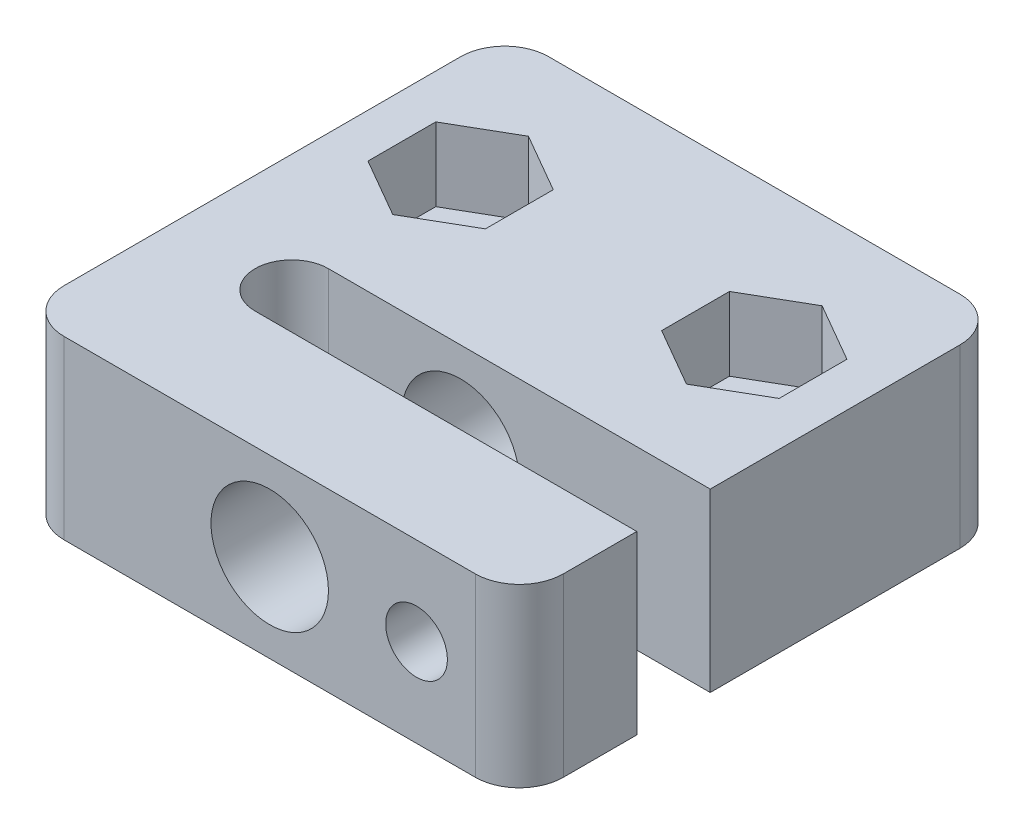
ISO-10303-21;
HEADER;
FILE_DESCRIPTION(('STEP AP214'),'2;1');
FILE_NAME('part.step','',(''),(''),'','','');
FILE_SCHEMA(('AUTOMOTIVE_DESIGN { 1 0 10303 214 1 1 1 1 }'));
ENDSEC;
DATA;
#1=APPLICATION_CONTEXT('core data for automotive mechanical design processes');
#2=APPLICATION_PROTOCOL_DEFINITION('international standard','automotive_design',2000,#1);
#3=PRODUCT_CONTEXT('',#1,'mechanical');
#4=PRODUCT('Part','Part','',(#3));
#5=PRODUCT_RELATED_PRODUCT_CATEGORY('part','',(#4));
#6=PRODUCT_DEFINITION_FORMATION('','',#4);
#7=PRODUCT_DEFINITION_CONTEXT('part definition',#1,'design');
#8=PRODUCT_DEFINITION('design','',#6,#7);
#9=PRODUCT_DEFINITION_SHAPE('','',#8);
#10=(LENGTH_UNIT() NAMED_UNIT(*) SI_UNIT(.MILLI.,.METRE.));
#11=(NAMED_UNIT(*) PLANE_ANGLE_UNIT() SI_UNIT($,.RADIAN.));
#12=(NAMED_UNIT(*) SI_UNIT($,.STERADIAN.) SOLID_ANGLE_UNIT());
#13=UNCERTAINTY_MEASURE_WITH_UNIT(LENGTH_MEASURE(1.E-05),#10,'distance_accuracy_value','');
#14=(GEOMETRIC_REPRESENTATION_CONTEXT(3) GLOBAL_UNCERTAINTY_ASSIGNED_CONTEXT((#13)) GLOBAL_UNIT_ASSIGNED_CONTEXT((#10,
#11,#12)) REPRESENTATION_CONTEXT('',''));
#15=CARTESIAN_POINT('',(0.,0.,0.));
#16=DIRECTION('',(0.,0.,1.));
#17=DIRECTION('',(1.,0.,0.));
#18=AXIS2_PLACEMENT_3D('',#15,#16,#17);
#19=CARTESIAN_POINT('',(17.,-6.,33.));
#20=DIRECTION('',(-1.,0.,0.));
#21=DIRECTION('',(0.,0.,1.));
#22=AXIS2_PLACEMENT_3D('',#19,#20,#21);
#23=PLANE('',#22);
#24=DIRECTION('',(0.,0.,-1.));
#25=VECTOR('',#24,1.);
#26=CARTESIAN_POINT('',(17.,6.,33.));
#27=LINE('',#26,#25);
#28=CARTESIAN_POINT('',(17.,6.,30.));
#29=VERTEX_POINT('',#28);
#30=CARTESIAN_POINT('',(17.,6.,25.));
#31=VERTEX_POINT('',#30);
#32=EDGE_CURVE('E226',#29,#31,#27,.T.);
#33=ORIENTED_EDGE('',*,*,#32,.F.);
#34=DIRECTION('',(0.,1.,0.));
#35=VECTOR('',#34,1.);
#36=CARTESIAN_POINT('',(17.,-6.,30.));
#37=LINE('',#36,#35);
#38=CARTESIAN_POINT('',(17.,-6.,30.));
#39=VERTEX_POINT('',#38);
#40=EDGE_CURVE('E11',#29,#39,#37,.F.);
#41=ORIENTED_EDGE('',*,*,#40,.T.);
#42=DIRECTION('',(0.,0.,-1.));
#43=VECTOR('',#42,1.);
#44=CARTESIAN_POINT('',(17.,-6.,33.));
#45=LINE('',#44,#43);
#46=CARTESIAN_POINT('',(17.,-6.,25.));
#47=VERTEX_POINT('',#46);
#48=EDGE_CURVE('E225',#39,#47,#45,.T.);
#49=ORIENTED_EDGE('',*,*,#48,.T.);
#50=DIRECTION('',(0.,1.,0.));
#51=VECTOR('',#50,1.);
#52=CARTESIAN_POINT('',(17.,-6.,25.));
#53=LINE('',#52,#51);
#54=EDGE_CURVE('E258',#47,#31,#53,.T.);
#55=ORIENTED_EDGE('',*,*,#54,.T.);
#56=EDGE_LOOP('',(#33,#41,#49,#55));
#57=FACE_BOUND('',#56,.T.);
#58=ADVANCED_FACE('F32',(#57),#23,.F.);
#59=CARTESIAN_POINT('',(0.,0.,0.));
#60=DIRECTION('',(0.,0.,1.));
#61=DIRECTION('',(1.,0.,0.));
#62=AXIS2_PLACEMENT_3D('',#59,#60,#61);
#63=CYLINDRICAL_SURFACE('',#62,4.);
#64=CARTESIAN_POINT('',(0.,0.,25.));
#65=DIRECTION('',(0.,0.,1.));
#66=DIRECTION('',(1.,0.,0.));
#67=AXIS2_PLACEMENT_3D('',#64,#65,#66);
#68=CIRCLE('',#67,4.);
#69=CARTESIAN_POINT('',(4.,0.,25.));
#70=VERTEX_POINT('',#69);
#71=EDGE_CURVE('E257',#70,#70,#68,.F.);
#72=ORIENTED_EDGE('',*,*,#71,.T.);
#73=EDGE_LOOP('',(#72));
#74=FACE_BOUND('',#73,.T.);
#75=CARTESIAN_POINT('',(0.,0.,33.));
#76=DIRECTION('',(0.,0.,1.));
#77=DIRECTION('',(1.,0.,0.));
#78=AXIS2_PLACEMENT_3D('',#75,#76,#77);
#79=CIRCLE('',#78,4.);
#80=CARTESIAN_POINT('',(4.,0.,33.));
#81=VERTEX_POINT('',#80);
#82=EDGE_CURVE('E237',#81,#81,#79,.T.);
#83=ORIENTED_EDGE('',*,*,#82,.T.);
#84=EDGE_LOOP('',(#83));
#85=FACE_BOUND('',#84,.T.);
#86=ADVANCED_FACE('F329',(#74,#85),#63,.F.);
#87=CARTESIAN_POINT('',(-10.,-6.00000000000001,10.));
#88=DIRECTION('',(0.,1.,0.));
#89=DIRECTION('',(-1.,0.,0.));
#90=AXIS2_PLACEMENT_3D('',#87,#88,#89);
#91=CYLINDRICAL_SURFACE('',#90,2.55);
#92=CARTESIAN_POINT('',(-10.,1.,10.));
#93=DIRECTION('',(0.,1.,0.));
#94=DIRECTION('',(0.,0.,1.));
#95=AXIS2_PLACEMENT_3D('',#92,#93,#94);
#96=CIRCLE('',#95,2.55);
#97=CARTESIAN_POINT('',(-10.,1.,12.55));
#98=VERTEX_POINT('',#97);
#99=EDGE_CURVE('E234',#98,#98,#96,.F.);
#100=ORIENTED_EDGE('',*,*,#99,.F.);
#101=EDGE_LOOP('',(#100));
#102=FACE_BOUND('',#101,.T.);
#103=CARTESIAN_POINT('',(-10.,-4.,10.));
#104=DIRECTION('',(0.,-1.,0.));
#105=DIRECTION('',(1.,0.,0.));
#106=AXIS2_PLACEMENT_3D('',#103,#104,#105);
#107=CIRCLE('',#106,2.55);
#108=CARTESIAN_POINT('',(-7.45,-4.,10.));
#109=VERTEX_POINT('',#108);
#110=EDGE_CURVE('E249',#109,#109,#107,.F.);
#111=ORIENTED_EDGE('',*,*,#110,.F.);
#112=EDGE_LOOP('',(#111));
#113=FACE_BOUND('',#112,.T.);
#114=ADVANCED_FACE('F335',(#102,#113),#91,.F.);
#115=CARTESIAN_POINT('',(10.,-6.00000000000001,10.));
#116=DIRECTION('',(0.,1.,0.));
#117=DIRECTION('',(-1.,0.,0.));
#118=AXIS2_PLACEMENT_3D('',#115,#116,#117);
#119=CYLINDRICAL_SURFACE('',#118,2.55);
#120=CARTESIAN_POINT('',(10.,1.,10.));
#121=DIRECTION('',(0.,-1.,0.));
#122=DIRECTION('',(1.,0.,0.));
#123=AXIS2_PLACEMENT_3D('',#120,#121,#122);
#124=CIRCLE('',#123,2.55);
#125=CARTESIAN_POINT('',(12.55,1.,10.));
#126=VERTEX_POINT('',#125);
#127=EDGE_CURVE('E239',#126,#126,#124,.F.);
#128=ORIENTED_EDGE('',*,*,#127,.T.);
#129=EDGE_LOOP('',(#128));
#130=FACE_BOUND('',#129,.T.);
#131=CARTESIAN_POINT('',(10.,-4.,10.));
#132=DIRECTION('',(0.,-1.,0.));
#133=DIRECTION('',(1.,0.,0.));
#134=AXIS2_PLACEMENT_3D('',#131,#132,#133);
#135=CIRCLE('',#134,2.55);
#136=CARTESIAN_POINT('',(12.55,-4.,10.));
#137=VERTEX_POINT('',#136);
#138=EDGE_CURVE('E244',#137,#137,#135,.F.);
#139=ORIENTED_EDGE('',*,*,#138,.F.);
#140=EDGE_LOOP('',(#139));
#141=FACE_BOUND('',#140,.T.);
#142=ADVANCED_FACE('F351',(#130,#141),#119,.F.);
#143=CARTESIAN_POINT('',(-17.,-6.,33.));
#144=DIRECTION('',(1.,0.,0.));
#145=DIRECTION('',(0.,0.,-1.));
#146=AXIS2_PLACEMENT_3D('',#143,#144,#145);
#147=PLANE('',#146);
#148=DIRECTION('',(0.,0.,-1.));
#149=VECTOR('',#148,1.);
#150=CARTESIAN_POINT('',(-17.,6.,33.));
#151=LINE('',#150,#149);
#152=CARTESIAN_POINT('',(-17.,6.,30.));
#153=VERTEX_POINT('',#152);
#154=CARTESIAN_POINT('',(-17.,6.,3.));
#155=VERTEX_POINT('',#154);
#156=EDGE_CURVE('E298',#153,#155,#151,.T.);
#157=ORIENTED_EDGE('',*,*,#156,.T.);
#158=DIRECTION('',(0.,-1.,0.));
#159=VECTOR('',#158,1.);
#160=CARTESIAN_POINT('',(-17.,-6.,3.));
#161=LINE('',#160,#159);
#162=CARTESIAN_POINT('',(-17.,-6.,3.));
#163=VERTEX_POINT('',#162);
#164=EDGE_CURVE('E263',#155,#163,#161,.T.);
#165=ORIENTED_EDGE('',*,*,#164,.T.);
#166=DIRECTION('',(0.,0.,-1.));
#167=VECTOR('',#166,1.);
#168=CARTESIAN_POINT('',(-17.,-6.,33.));
#169=LINE('',#168,#167);
#170=CARTESIAN_POINT('',(-17.,-6.,30.));
#171=VERTEX_POINT('',#170);
#172=EDGE_CURVE('E228',#171,#163,#169,.T.);
#173=ORIENTED_EDGE('',*,*,#172,.F.);
#174=DIRECTION('',(0.,-1.,0.));
#175=VECTOR('',#174,1.);
#176=CARTESIAN_POINT('',(-17.,6.,30.));
#177=LINE('',#176,#175);
#178=EDGE_CURVE('E233',#171,#153,#177,.F.);
#179=ORIENTED_EDGE('',*,*,#178,.T.);
#180=EDGE_LOOP('',(#157,#165,#173,#179));
#181=FACE_BOUND('',#180,.T.);
#182=ADVANCED_FACE('F318',(#181),#147,.F.);
#183=CARTESIAN_POINT('',(17.,-6.,33.));
#184=DIRECTION('',(0.,1.,0.));
#185=DIRECTION('',(-1.,0.,0.));
#186=AXIS2_PLACEMENT_3D('',#183,#184,#185);
#187=PLANE('',#186);
#188=CARTESIAN_POINT('',(-10.,-6.,10.));
#189=DIRECTION('',(0.,-1.,0.));
#190=DIRECTION('',(1.,0.,0.));
#191=AXIS2_PLACEMENT_3D('',#188,#189,#190);
#192=CIRCLE('',#191,4.5);
#193=CARTESIAN_POINT('',(-5.5,-6.,10.));
#194=VERTEX_POINT('',#193);
#195=EDGE_CURVE('E261',#194,#194,#192,.T.);
#196=ORIENTED_EDGE('',*,*,#195,.F.);
#197=EDGE_LOOP('',(#196));
#198=FACE_BOUND('',#197,.T.);
#199=CARTESIAN_POINT('',(10.,-6.,10.));
#200=DIRECTION('',(0.,-1.,0.));
#201=DIRECTION('',(1.,0.,0.));
#202=AXIS2_PLACEMENT_3D('',#199,#200,#201);
#203=CIRCLE('',#202,4.5);
#204=CARTESIAN_POINT('',(14.5,-6.,10.));
#205=VERTEX_POINT('',#204);
#206=EDGE_CURVE('E252',#205,#205,#203,.T.);
#207=ORIENTED_EDGE('',*,*,#206,.F.);
#208=EDGE_LOOP('',(#207));
#209=FACE_BOUND('',#208,.T.);
#210=ORIENTED_EDGE('',*,*,#172,.T.);
#211=CARTESIAN_POINT('',(-14.,-6.,3.));
#212=DIRECTION('',(0.,1.,0.));
#213=DIRECTION('',(-1.,0.,0.));
#214=AXIS2_PLACEMENT_3D('',#211,#212,#213);
#215=CIRCLE('',#214,3.);
#216=CARTESIAN_POINT('',(-14.,-6.,0.));
#217=VERTEX_POINT('',#216);
#218=EDGE_CURVE('E271',#163,#217,#215,.F.);
#219=ORIENTED_EDGE('',*,*,#218,.T.);
#220=DIRECTION('',(1.,0.,0.));
#221=VECTOR('',#220,1.);
#222=CARTESIAN_POINT('',(17.,-6.,0.));
#223=LINE('',#222,#221);
#224=CARTESIAN_POINT('',(14.,-6.,0.));
#225=VERTEX_POINT('',#224);
#226=EDGE_CURVE('E305',#217,#225,#223,.T.);
#227=ORIENTED_EDGE('',*,*,#226,.T.);
#228=CARTESIAN_POINT('',(14.,-6.,3.));
#229=DIRECTION('',(0.,1.,0.));
#230=DIRECTION('',(-1.,0.,0.));
#231=AXIS2_PLACEMENT_3D('',#228,#229,#230);
#232=CIRCLE('',#231,3.);
#233=CARTESIAN_POINT('',(17.,-6.,3.));
#234=VERTEX_POINT('',#233);
#235=EDGE_CURVE('E224',#225,#234,#232,.F.);
#236=ORIENTED_EDGE('',*,*,#235,.T.);
#237=CARTESIAN_POINT('',(17.,-6.,20.));
#238=VERTEX_POINT('',#237);
#239=EDGE_CURVE('E214',#238,#234,#45,.T.);
#240=ORIENTED_EDGE('',*,*,#239,.F.);
#241=DIRECTION('',(-1.,0.,0.));
#242=VECTOR('',#241,1.);
#243=CARTESIAN_POINT('',(17.,-6.,20.));
#244=LINE('',#243,#242);
#245=CARTESIAN_POINT('',(-9.,-6.00000000000001,20.));
#246=VERTEX_POINT('',#245);
#247=EDGE_CURVE('E194',#238,#246,#244,.T.);
#248=ORIENTED_EDGE('',*,*,#247,.T.);
#249=CARTESIAN_POINT('',(-9.,-6.00000000000001,22.5));
#250=DIRECTION('',(0.,1.,0.));
#251=DIRECTION('',(-1.,0.,0.));
#252=AXIS2_PLACEMENT_3D('',#249,#250,#251);
#253=CIRCLE('',#252,2.5);
#254=CARTESIAN_POINT('',(-9.,-6.00000000000001,25.));
#255=VERTEX_POINT('',#254);
#256=EDGE_CURVE('E206',#246,#255,#253,.T.);
#257=ORIENTED_EDGE('',*,*,#256,.T.);
#258=DIRECTION('',(1.,0.,0.));
#259=VECTOR('',#258,1.);
#260=CARTESIAN_POINT('',(17.,-6.,25.));
#261=LINE('',#260,#259);
#262=EDGE_CURVE('E218',#255,#47,#261,.T.);
#263=ORIENTED_EDGE('',*,*,#262,.T.);
#264=ORIENTED_EDGE('',*,*,#48,.F.);
#265=CARTESIAN_POINT('',(14.,-6.,30.));
#266=DIRECTION('',(0.,1.,0.));
#267=DIRECTION('',(-1.,0.,0.));
#268=AXIS2_PLACEMENT_3D('',#265,#266,#267);
#269=CIRCLE('',#268,3.);
#270=CARTESIAN_POINT('',(14.,-6.,33.));
#271=VERTEX_POINT('',#270);
#272=EDGE_CURVE('E268',#39,#271,#269,.F.);
#273=ORIENTED_EDGE('',*,*,#272,.T.);
#274=DIRECTION('',(1.,0.,0.));
#275=VECTOR('',#274,1.);
#276=CARTESIAN_POINT('',(17.,-6.,33.));
#277=LINE('',#276,#275);
#278=CARTESIAN_POINT('',(-14.,-6.,33.));
#279=VERTEX_POINT('',#278);
#280=EDGE_CURVE('E293',#279,#271,#277,.T.);
#281=ORIENTED_EDGE('',*,*,#280,.F.);
#282=CARTESIAN_POINT('',(-14.,-6.,30.));
#283=DIRECTION('',(0.,1.,0.));
#284=DIRECTION('',(-1.,0.,0.));
#285=AXIS2_PLACEMENT_3D('',#282,#283,#284);
#286=CIRCLE('',#285,3.);
#287=EDGE_CURVE('E266',#279,#171,#286,.F.);
#288=ORIENTED_EDGE('',*,*,#287,.T.);
#289=EDGE_LOOP('',(#210,#219,#227,#236,#240,#248,#257,#263,#264,#273,#281,#288));
#290=FACE_BOUND('',#289,.T.);
#291=ADVANCED_FACE('F221',(#198,#209,#290),#187,.F.);
#292=ORIENTED_EDGE('',*,*,#239,.T.);
#293=DIRECTION('',(0.,1.,0.));
#294=VECTOR('',#293,1.);
#295=CARTESIAN_POINT('',(17.,-6.,3.));
#296=LINE('',#295,#294);
#297=CARTESIAN_POINT('',(17.,6.,3.));
#298=VERTEX_POINT('',#297);
#299=EDGE_CURVE('E283',#234,#298,#296,.T.);
#300=ORIENTED_EDGE('',*,*,#299,.T.);
#301=CARTESIAN_POINT('',(17.,6.,20.));
#302=VERTEX_POINT('',#301);
#303=EDGE_CURVE('E217',#302,#298,#27,.T.);
#304=ORIENTED_EDGE('',*,*,#303,.F.);
#305=DIRECTION('',(0.,1.,0.));
#306=VECTOR('',#305,1.);
#307=CARTESIAN_POINT('',(17.,-6.,20.));
#308=LINE('',#307,#306);
#309=EDGE_CURVE('E199',#238,#302,#308,.T.);
#310=ORIENTED_EDGE('',*,*,#309,.F.);
#311=EDGE_LOOP('',(#292,#300,#304,#310));
#312=FACE_BOUND('',#311,.T.);
#313=ADVANCED_FACE('F212',(#312),#23,.F.);
#314=CARTESIAN_POINT('',(17.,6.,33.));
#315=DIRECTION('',(0.,-1.,0.));
#316=DIRECTION('',(1.,0.,0.));
#317=AXIS2_PLACEMENT_3D('',#314,#315,#316);
#318=PLANE('',#317);
#319=DIRECTION('',(0.866025403784438,0.,0.5));
#320=VECTOR('',#319,1.);
#321=CARTESIAN_POINT('',(10.,6.,14.618802153517));
#322=LINE('',#321,#320);
#323=CARTESIAN_POINT('',(6.00000000000001,6.,12.3094010767585));
#324=VERTEX_POINT('',#323);
#325=CARTESIAN_POINT('',(10.,6.,14.618802153517));
#326=VERTEX_POINT('',#325);
#327=EDGE_CURVE('E413',#324,#326,#322,.T.);
#328=ORIENTED_EDGE('',*,*,#327,.F.);
#329=DIRECTION('',(0.,0.,1.));
#330=VECTOR('',#329,1.);
#331=CARTESIAN_POINT('',(6.00000000000001,6.,12.3094010767585));
#332=LINE('',#331,#330);
#333=CARTESIAN_POINT('',(6.,6.,7.6905989232415));
#334=VERTEX_POINT('',#333);
#335=EDGE_CURVE('E247',#334,#324,#332,.T.);
#336=ORIENTED_EDGE('',*,*,#335,.F.);
#337=DIRECTION('',(-0.866025403784439,0.,0.5));
#338=VECTOR('',#337,1.);
#339=CARTESIAN_POINT('',(6.,6.,7.6905989232415));
#340=LINE('',#339,#338);
#341=CARTESIAN_POINT('',(10.,6.,5.381197846483));
#342=VERTEX_POINT('',#341);
#343=EDGE_CURVE('E396',#342,#334,#340,.T.);
#344=ORIENTED_EDGE('',*,*,#343,.F.);
#345=DIRECTION('',(-0.866025403784439,0.,-0.5));
#346=VECTOR('',#345,1.);
#347=CARTESIAN_POINT('',(10.,6.,5.381197846483));
#348=LINE('',#347,#346);
#349=CARTESIAN_POINT('',(14.,6.,7.6905989232415));
#350=VERTEX_POINT('',#349);
#351=EDGE_CURVE('E422',#350,#342,#348,.T.);
#352=ORIENTED_EDGE('',*,*,#351,.F.);
#353=DIRECTION('',(0.,0.,-1.));
#354=VECTOR('',#353,1.);
#355=CARTESIAN_POINT('',(14.,6.,7.6905989232415));
#356=LINE('',#355,#354);
#357=CARTESIAN_POINT('',(14.,6.,12.3094010767585));
#358=VERTEX_POINT('',#357);
#359=EDGE_CURVE('E419',#358,#350,#356,.T.);
#360=ORIENTED_EDGE('',*,*,#359,.F.);
#361=DIRECTION('',(0.866025403784439,0.,-0.5));
#362=VECTOR('',#361,1.);
#363=CARTESIAN_POINT('',(14.,6.,12.3094010767585));
#364=LINE('',#363,#362);
#365=EDGE_CURVE('E416',#326,#358,#364,.T.);
#366=ORIENTED_EDGE('',*,*,#365,.F.);
#367=EDGE_LOOP('',(#328,#336,#344,#352,#360,#366));
#368=FACE_BOUND('',#367,.T.);
#369=DIRECTION('',(-0.866025403784439,0.,0.5));
#370=VECTOR('',#369,1.);
#371=CARTESIAN_POINT('',(-10.,6.,5.381197846483));
#372=LINE('',#371,#370);
#373=CARTESIAN_POINT('',(-10.,6.,5.381197846483));
#374=VERTEX_POINT('',#373);
#375=CARTESIAN_POINT('',(-14.,6.,7.6905989232415));
#376=VERTEX_POINT('',#375);
#377=EDGE_CURVE('E459',#374,#376,#372,.T.);
#378=ORIENTED_EDGE('',*,*,#377,.F.);
#379=DIRECTION('',(-0.866025403784439,0.,-0.5));
#380=VECTOR('',#379,1.);
#381=CARTESIAN_POINT('',(-6.00000000000001,6.,7.6905989232415));
#382=LINE('',#381,#380);
#383=CARTESIAN_POINT('',(-6.00000000000001,6.,7.6905989232415));
#384=VERTEX_POINT('',#383);
#385=EDGE_CURVE('E242',#384,#374,#382,.T.);
#386=ORIENTED_EDGE('',*,*,#385,.F.);
#387=DIRECTION('',(0.,0.,-1.));
#388=VECTOR('',#387,1.);
#389=CARTESIAN_POINT('',(-6.00000000000001,6.,12.3094010767585));
#390=LINE('',#389,#388);
#391=CARTESIAN_POINT('',(-6.00000000000001,6.,12.3094010767585));
#392=VERTEX_POINT('',#391);
#393=EDGE_CURVE('E442',#392,#384,#390,.T.);
#394=ORIENTED_EDGE('',*,*,#393,.F.);
#395=DIRECTION('',(0.866025403784438,0.,-0.5));
#396=VECTOR('',#395,1.);
#397=CARTESIAN_POINT('',(-10.,6.,14.618802153517));
#398=LINE('',#397,#396);
#399=CARTESIAN_POINT('',(-10.,6.,14.618802153517));
#400=VERTEX_POINT('',#399);
#401=EDGE_CURVE('E468',#400,#392,#398,.T.);
#402=ORIENTED_EDGE('',*,*,#401,.F.);
#403=DIRECTION('',(0.866025403784439,0.,0.5));
#404=VECTOR('',#403,1.);
#405=CARTESIAN_POINT('',(-14.,6.,12.3094010767585));
#406=LINE('',#405,#404);
#407=CARTESIAN_POINT('',(-14.,6.,12.3094010767585));
#408=VERTEX_POINT('',#407);
#409=EDGE_CURVE('E465',#408,#400,#406,.T.);
#410=ORIENTED_EDGE('',*,*,#409,.F.);
#411=DIRECTION('',(0.,0.,1.));
#412=VECTOR('',#411,1.);
#413=CARTESIAN_POINT('',(-14.,6.,7.6905989232415));
#414=LINE('',#413,#412);
#415=EDGE_CURVE('E462',#376,#408,#414,.T.);
#416=ORIENTED_EDGE('',*,*,#415,.F.);
#417=EDGE_LOOP('',(#378,#386,#394,#402,#410,#416));
#418=FACE_BOUND('',#417,.T.);
#419=DIRECTION('',(-1.,0.,0.));
#420=VECTOR('',#419,1.);
#421=CARTESIAN_POINT('',(17.,6.,0.));
#422=LINE('',#421,#420);
#423=CARTESIAN_POINT('',(14.,6.,0.));
#424=VERTEX_POINT('',#423);
#425=CARTESIAN_POINT('',(-14.,6.,0.));
#426=VERTEX_POINT('',#425);
#427=EDGE_CURVE('E301',#424,#426,#422,.T.);
#428=ORIENTED_EDGE('',*,*,#427,.T.);
#429=CARTESIAN_POINT('',(-14.,6.,3.));
#430=DIRECTION('',(0.,-1.,0.));
#431=DIRECTION('',(1.,0.,0.));
#432=AXIS2_PLACEMENT_3D('',#429,#430,#431);
#433=CIRCLE('',#432,3.);
#434=EDGE_CURVE('E281',#426,#155,#433,.F.);
#435=ORIENTED_EDGE('',*,*,#434,.T.);
#436=ORIENTED_EDGE('',*,*,#156,.F.);
#437=CARTESIAN_POINT('',(-14.,6.,30.));
#438=DIRECTION('',(0.,-1.,0.));
#439=DIRECTION('',(1.,0.,0.));
#440=AXIS2_PLACEMENT_3D('',#437,#438,#439);
#441=CIRCLE('',#440,3.);
#442=CARTESIAN_POINT('',(-14.,6.,33.));
#443=VERTEX_POINT('',#442);
#444=EDGE_CURVE('E47',#153,#443,#441,.F.);
#445=ORIENTED_EDGE('',*,*,#444,.T.);
#446=DIRECTION('',(-1.,0.,0.));
#447=VECTOR('',#446,1.);
#448=CARTESIAN_POINT('',(17.,6.,33.));
#449=LINE('',#448,#447);
#450=CARTESIAN_POINT('',(14.,6.,33.));
#451=VERTEX_POINT('',#450);
#452=EDGE_CURVE('E290',#451,#443,#449,.T.);
#453=ORIENTED_EDGE('',*,*,#452,.F.);
#454=CARTESIAN_POINT('',(14.,6.,30.));
#455=DIRECTION('',(0.,-1.,0.));
#456=DIRECTION('',(1.,0.,0.));
#457=AXIS2_PLACEMENT_3D('',#454,#455,#456);
#458=CIRCLE('',#457,3.);
#459=EDGE_CURVE('E55',#451,#29,#458,.F.);
#460=ORIENTED_EDGE('',*,*,#459,.T.);
#461=ORIENTED_EDGE('',*,*,#32,.T.);
#462=DIRECTION('',(1.,0.,0.));
#463=VECTOR('',#462,1.);
#464=CARTESIAN_POINT('',(17.,6.,25.));
#465=LINE('',#464,#463);
#466=CARTESIAN_POINT('',(-9.,6.,25.));
#467=VERTEX_POINT('',#466);
#468=EDGE_CURVE('E207',#467,#31,#465,.T.);
#469=ORIENTED_EDGE('',*,*,#468,.F.);
#470=CARTESIAN_POINT('',(-9.,6.,22.5));
#471=DIRECTION('',(0.,1.,0.));
#472=DIRECTION('',(-1.,0.,0.));
#473=AXIS2_PLACEMENT_3D('',#470,#471,#472);
#474=CIRCLE('',#473,2.5);
#475=CARTESIAN_POINT('',(-9.,6.,20.));
#476=VERTEX_POINT('',#475);
#477=EDGE_CURVE('E367',#476,#467,#474,.T.);
#478=ORIENTED_EDGE('',*,*,#477,.F.);
#479=DIRECTION('',(-1.,0.,0.));
#480=VECTOR('',#479,1.);
#481=CARTESIAN_POINT('',(17.,6.,20.));
#482=LINE('',#481,#480);
#483=EDGE_CURVE('E364',#302,#476,#482,.T.);
#484=ORIENTED_EDGE('',*,*,#483,.F.);
#485=ORIENTED_EDGE('',*,*,#303,.T.);
#486=CARTESIAN_POINT('',(14.,6.,3.));
#487=DIRECTION('',(0.,-1.,0.));
#488=DIRECTION('',(1.,0.,0.));
#489=AXIS2_PLACEMENT_3D('',#486,#487,#488);
#490=CIRCLE('',#489,3.);
#491=EDGE_CURVE('E279',#298,#424,#490,.F.);
#492=ORIENTED_EDGE('',*,*,#491,.T.);
#493=EDGE_LOOP('',(#428,#435,#436,#445,#453,#460,#461,#469,#478,#484,#485,#492));
#494=FACE_BOUND('',#493,.T.);
#495=ADVANCED_FACE('F296',(#368,#418,#494),#318,.F.);
#496=CARTESIAN_POINT('',(0.,0.,33.));
#497=DIRECTION('',(0.,0.,1.));
#498=DIRECTION('',(1.,0.,0.));
#499=AXIS2_PLACEMENT_3D('',#496,#497,#498);
#500=PLANE('',#499);
#501=CARTESIAN_POINT('',(10.,0.,33.));
#502=DIRECTION('',(0.,0.,1.));
#503=DIRECTION('',(1.,0.,0.));
#504=AXIS2_PLACEMENT_3D('',#501,#502,#503);
#505=CIRCLE('',#504,2.09999999999999);
#506=CARTESIAN_POINT('',(12.1,0.,33.));
#507=VERTEX_POINT('',#506);
#508=EDGE_CURVE('E372',#507,#507,#505,.T.);
#509=ORIENTED_EDGE('',*,*,#508,.F.);
#510=EDGE_LOOP('',(#509));
#511=FACE_BOUND('',#510,.T.);
#512=ORIENTED_EDGE('',*,*,#82,.F.);
#513=EDGE_LOOP('',(#512));
#514=FACE_BOUND('',#513,.T.);
#515=ORIENTED_EDGE('',*,*,#280,.T.);
#516=DIRECTION('',(0.,1.,0.));
#517=VECTOR('',#516,1.);
#518=CARTESIAN_POINT('',(14.,6.,33.));
#519=LINE('',#518,#517);
#520=EDGE_CURVE('E40',#271,#451,#519,.T.);
#521=ORIENTED_EDGE('',*,*,#520,.T.);
#522=ORIENTED_EDGE('',*,*,#452,.T.);
#523=DIRECTION('',(0.,-1.,0.));
#524=VECTOR('',#523,1.);
#525=CARTESIAN_POINT('',(-14.,-6.,33.));
#526=LINE('',#525,#524);
#527=EDGE_CURVE('E285',#443,#279,#526,.T.);
#528=ORIENTED_EDGE('',*,*,#527,.T.);
#529=EDGE_LOOP('',(#515,#521,#522,#528));
#530=FACE_BOUND('',#529,.T.);
#531=ADVANCED_FACE('F289',(#511,#514,#530),#500,.T.);
#532=CARTESIAN_POINT('',(0.,0.,0.));
#533=DIRECTION('',(0.,0.,1.));
#534=DIRECTION('',(1.,0.,0.));
#535=AXIS2_PLACEMENT_3D('',#532,#533,#534);
#536=PLANE('',#535);
#537=CARTESIAN_POINT('',(0.,0.,0.));
#538=DIRECTION('',(0.,0.,1.));
#539=DIRECTION('',(1.,0.,0.));
#540=AXIS2_PLACEMENT_3D('',#537,#538,#539);
#541=CIRCLE('',#540,4.);
#542=CARTESIAN_POINT('',(4.,0.,0.));
#543=VERTEX_POINT('',#542);
#544=EDGE_CURVE('E307',#543,#543,#541,.T.);
#545=ORIENTED_EDGE('',*,*,#544,.T.);
#546=EDGE_LOOP('',(#545));
#547=FACE_BOUND('',#546,.T.);
#548=ORIENTED_EDGE('',*,*,#226,.F.);
#549=DIRECTION('',(0.,-1.,0.));
#550=VECTOR('',#549,1.);
#551=CARTESIAN_POINT('',(-14.,0.,0.));
#552=LINE('',#551,#550);
#553=EDGE_CURVE('E275',#217,#426,#552,.F.);
#554=ORIENTED_EDGE('',*,*,#553,.T.);
#555=ORIENTED_EDGE('',*,*,#427,.F.);
#556=DIRECTION('',(0.,1.,0.));
#557=VECTOR('',#556,1.);
#558=CARTESIAN_POINT('',(14.,0.,0.));
#559=LINE('',#558,#557);
#560=EDGE_CURVE('E273',#424,#225,#559,.F.);
#561=ORIENTED_EDGE('',*,*,#560,.T.);
#562=EDGE_LOOP('',(#548,#554,#555,#561));
#563=FACE_BOUND('',#562,.T.);
#564=ADVANCED_FACE('F490',(#547,#563),#536,.F.);
#565=CARTESIAN_POINT('',(0.,0.,20.));
#566=DIRECTION('',(0.,0.,-1.));
#567=DIRECTION('',(-1.,0.,0.));
#568=AXIS2_PLACEMENT_3D('',#565,#566,#567);
#569=CIRCLE('',#568,4.);
#570=CARTESIAN_POINT('',(-4.,0.,20.));
#571=VERTEX_POINT('',#570);
#572=EDGE_CURVE('E254',#571,#571,#569,.F.);
#573=ORIENTED_EDGE('',*,*,#572,.T.);
#574=EDGE_LOOP('',(#573));
#575=FACE_BOUND('',#574,.T.);
#576=ORIENTED_EDGE('',*,*,#544,.F.);
#577=EDGE_LOOP('',(#576));
#578=FACE_BOUND('',#577,.T.);
#579=ADVANCED_FACE('F338',(#575,#578),#63,.F.);
#580=CARTESIAN_POINT('',(0.,1.,0.));
#581=DIRECTION('',(0.,1.,0.));
#582=DIRECTION('',(0.,0.,1.));
#583=AXIS2_PLACEMENT_3D('',#580,#581,#582);
#584=PLANE('',#583);
#585=DIRECTION('',(-0.866025403784439,0.,-0.5));
#586=VECTOR('',#585,1.);
#587=CARTESIAN_POINT('',(-6.00000000000001,1.,7.6905989232415));
#588=LINE('',#587,#586);
#589=CARTESIAN_POINT('',(-6.00000000000001,1.,7.6905989232415));
#590=VERTEX_POINT('',#589);
#591=CARTESIAN_POINT('',(-10.,1.,5.381197846483));
#592=VERTEX_POINT('',#591);
#593=EDGE_CURVE('E438',#590,#592,#588,.T.);
#594=ORIENTED_EDGE('',*,*,#593,.T.);
#595=DIRECTION('',(-0.866025403784439,0.,0.5));
#596=VECTOR('',#595,1.);
#597=CARTESIAN_POINT('',(-10.,1.,5.381197846483));
#598=LINE('',#597,#596);
#599=CARTESIAN_POINT('',(-14.,1.,7.6905989232415));
#600=VERTEX_POINT('',#599);
#601=EDGE_CURVE('E441',#592,#600,#598,.T.);
#602=ORIENTED_EDGE('',*,*,#601,.T.);
#603=DIRECTION('',(0.,0.,1.));
#604=VECTOR('',#603,1.);
#605=CARTESIAN_POINT('',(-14.,1.,7.6905989232415));
#606=LINE('',#605,#604);
#607=CARTESIAN_POINT('',(-14.,1.,12.3094010767585));
#608=VERTEX_POINT('',#607);
#609=EDGE_CURVE('E445',#600,#608,#606,.T.);
#610=ORIENTED_EDGE('',*,*,#609,.T.);
#611=DIRECTION('',(0.866025403784439,0.,0.5));
#612=VECTOR('',#611,1.);
#613=CARTESIAN_POINT('',(-14.,1.,12.3094010767585));
#614=LINE('',#613,#612);
#615=CARTESIAN_POINT('',(-10.,1.,14.618802153517));
#616=VERTEX_POINT('',#615);
#617=EDGE_CURVE('E448',#608,#616,#614,.T.);
#618=ORIENTED_EDGE('',*,*,#617,.T.);
#619=DIRECTION('',(0.866025403784438,0.,-0.5));
#620=VECTOR('',#619,1.);
#621=CARTESIAN_POINT('',(-10.,1.,14.618802153517));
#622=LINE('',#621,#620);
#623=CARTESIAN_POINT('',(-6.00000000000001,1.,12.3094010767585));
#624=VERTEX_POINT('',#623);
#625=EDGE_CURVE('E451',#616,#624,#622,.T.);
#626=ORIENTED_EDGE('',*,*,#625,.T.);
#627=DIRECTION('',(0.,0.,-1.));
#628=VECTOR('',#627,1.);
#629=CARTESIAN_POINT('',(-6.00000000000001,1.,12.3094010767585));
#630=LINE('',#629,#628);
#631=EDGE_CURVE('E454',#624,#590,#630,.T.);
#632=ORIENTED_EDGE('',*,*,#631,.T.);
#633=EDGE_LOOP('',(#594,#602,#610,#618,#626,#632));
#634=FACE_BOUND('',#633,.T.);
#635=ORIENTED_EDGE('',*,*,#99,.T.);
#636=EDGE_LOOP('',(#635));
#637=FACE_BOUND('',#636,.T.);
#638=ADVANCED_FACE('F501',(#634,#637),#584,.T.);
#639=CARTESIAN_POINT('',(-6.00000000000001,1.,7.6905989232415));
#640=DIRECTION('',(0.5,0.,-0.866025403784439));
#641=DIRECTION('',(-0.866025403784439,0.,-0.5));
#642=AXIS2_PLACEMENT_3D('',#639,#640,#641);
#643=PLANE('',#642);
#644=ORIENTED_EDGE('',*,*,#385,.T.);
#645=DIRECTION('',(0.,1.,0.));
#646=VECTOR('',#645,1.);
#647=CARTESIAN_POINT('',(-10.,1.,5.381197846483));
#648=LINE('',#647,#646);
#649=EDGE_CURVE('E457',#592,#374,#648,.T.);
#650=ORIENTED_EDGE('',*,*,#649,.F.);
#651=ORIENTED_EDGE('',*,*,#593,.F.);
#652=DIRECTION('',(0.,1.,0.));
#653=VECTOR('',#652,1.);
#654=CARTESIAN_POINT('',(-6.00000000000001,1.,7.6905989232415));
#655=LINE('',#654,#653);
#656=EDGE_CURVE('E238',#590,#384,#655,.T.);
#657=ORIENTED_EDGE('',*,*,#656,.T.);
#658=EDGE_LOOP('',(#644,#650,#651,#657));
#659=FACE_BOUND('',#658,.T.);
#660=ADVANCED_FACE('F509',(#659),#643,.F.);
#661=CARTESIAN_POINT('',(-6.00000000000001,1.,12.3094010767585));
#662=DIRECTION('',(1.,0.,0.));
#663=DIRECTION('',(0.,0.,-1.));
#664=AXIS2_PLACEMENT_3D('',#661,#662,#663);
#665=PLANE('',#664);
#666=ORIENTED_EDGE('',*,*,#393,.T.);
#667=ORIENTED_EDGE('',*,*,#656,.F.);
#668=ORIENTED_EDGE('',*,*,#631,.F.);
#669=DIRECTION('',(0.,1.,0.));
#670=VECTOR('',#669,1.);
#671=CARTESIAN_POINT('',(-6.00000000000001,1.,12.3094010767585));
#672=LINE('',#671,#670);
#673=EDGE_CURVE('E474',#624,#392,#672,.T.);
#674=ORIENTED_EDGE('',*,*,#673,.T.);
#675=EDGE_LOOP('',(#666,#667,#668,#674));
#676=FACE_BOUND('',#675,.T.);
#677=ADVANCED_FACE('F512',(#676),#665,.F.);
#678=CARTESIAN_POINT('',(-10.,1.,14.618802153517));
#679=DIRECTION('',(0.5,0.,0.866025403784438));
#680=DIRECTION('',(0.866025403784438,0.,-0.5));
#681=AXIS2_PLACEMENT_3D('',#678,#679,#680);
#682=PLANE('',#681);
#683=ORIENTED_EDGE('',*,*,#401,.T.);
#684=ORIENTED_EDGE('',*,*,#673,.F.);
#685=ORIENTED_EDGE('',*,*,#625,.F.);
#686=DIRECTION('',(0.,1.,0.));
#687=VECTOR('',#686,1.);
#688=CARTESIAN_POINT('',(-10.,1.,14.618802153517));
#689=LINE('',#688,#687);
#690=EDGE_CURVE('E476',#616,#400,#689,.T.);
#691=ORIENTED_EDGE('',*,*,#690,.T.);
#692=EDGE_LOOP('',(#683,#684,#685,#691));
#693=FACE_BOUND('',#692,.T.);
#694=ADVANCED_FACE('F526',(#693),#682,.F.);
#695=CARTESIAN_POINT('',(-14.,1.,12.3094010767585));
#696=DIRECTION('',(-0.5,0.,0.866025403784438));
#697=DIRECTION('',(0.866025403784439,0.,0.5));
#698=AXIS2_PLACEMENT_3D('',#695,#696,#697);
#699=PLANE('',#698);
#700=ORIENTED_EDGE('',*,*,#409,.T.);
#701=ORIENTED_EDGE('',*,*,#690,.F.);
#702=ORIENTED_EDGE('',*,*,#617,.F.);
#703=DIRECTION('',(0.,1.,0.));
#704=VECTOR('',#703,1.);
#705=CARTESIAN_POINT('',(-14.,1.,12.3094010767585));
#706=LINE('',#705,#704);
#707=EDGE_CURVE('E478',#608,#408,#706,.T.);
#708=ORIENTED_EDGE('',*,*,#707,.T.);
#709=EDGE_LOOP('',(#700,#701,#702,#708));
#710=FACE_BOUND('',#709,.T.);
#711=ADVANCED_FACE('F522',(#710),#699,.F.);
#712=CARTESIAN_POINT('',(-14.,1.,7.6905989232415));
#713=DIRECTION('',(-1.,0.,0.));
#714=DIRECTION('',(0.,-1.,0.));
#715=AXIS2_PLACEMENT_3D('',#712,#713,#714);
#716=PLANE('',#715);
#717=ORIENTED_EDGE('',*,*,#415,.T.);
#718=ORIENTED_EDGE('',*,*,#707,.F.);
#719=ORIENTED_EDGE('',*,*,#609,.F.);
#720=DIRECTION('',(0.,1.,0.));
#721=VECTOR('',#720,1.);
#722=CARTESIAN_POINT('',(-14.,1.,7.6905989232415));
#723=LINE('',#722,#721);
#724=EDGE_CURVE('E480',#600,#376,#723,.T.);
#725=ORIENTED_EDGE('',*,*,#724,.T.);
#726=EDGE_LOOP('',(#717,#718,#719,#725));
#727=FACE_BOUND('',#726,.T.);
#728=ADVANCED_FACE('F518',(#727),#716,.F.);
#729=CARTESIAN_POINT('',(-10.,1.,5.381197846483));
#730=DIRECTION('',(-0.5,0.,-0.866025403784439));
#731=DIRECTION('',(-0.866025403784439,0.,0.5));
#732=AXIS2_PLACEMENT_3D('',#729,#730,#731);
#733=PLANE('',#732);
#734=ORIENTED_EDGE('',*,*,#377,.T.);
#735=ORIENTED_EDGE('',*,*,#724,.F.);
#736=ORIENTED_EDGE('',*,*,#601,.F.);
#737=ORIENTED_EDGE('',*,*,#649,.T.);
#738=EDGE_LOOP('',(#734,#735,#736,#737));
#739=FACE_BOUND('',#738,.T.);
#740=ADVANCED_FACE('F514',(#739),#733,.F.);
#741=CARTESIAN_POINT('',(0.,1.,0.));
#742=DIRECTION('',(0.,-1.,0.));
#743=DIRECTION('',(1.,0.,0.));
#744=AXIS2_PLACEMENT_3D('',#741,#742,#743);
#745=PLANE('',#744);
#746=DIRECTION('',(0.,0.,1.));
#747=VECTOR('',#746,1.);
#748=CARTESIAN_POINT('',(6.00000000000001,1.,12.3094010767585));
#749=LINE('',#748,#747);
#750=CARTESIAN_POINT('',(6.00000000000001,1.,7.6905989232415));
#751=VERTEX_POINT('',#750);
#752=CARTESIAN_POINT('',(6.00000000000001,1.,12.3094010767585));
#753=VERTEX_POINT('',#752);
#754=EDGE_CURVE('E392',#751,#753,#749,.T.);
#755=ORIENTED_EDGE('',*,*,#754,.T.);
#756=DIRECTION('',(0.866025403784438,0.,0.5));
#757=VECTOR('',#756,1.);
#758=CARTESIAN_POINT('',(10.,1.,14.618802153517));
#759=LINE('',#758,#757);
#760=CARTESIAN_POINT('',(10.,1.,14.618802153517));
#761=VERTEX_POINT('',#760);
#762=EDGE_CURVE('E395',#753,#761,#759,.T.);
#763=ORIENTED_EDGE('',*,*,#762,.T.);
#764=DIRECTION('',(0.866025403784439,0.,-0.5));
#765=VECTOR('',#764,1.);
#766=CARTESIAN_POINT('',(14.,1.,12.3094010767585));
#767=LINE('',#766,#765);
#768=CARTESIAN_POINT('',(14.,1.,12.3094010767585));
#769=VERTEX_POINT('',#768);
#770=EDGE_CURVE('E399',#761,#769,#767,.T.);
#771=ORIENTED_EDGE('',*,*,#770,.T.);
#772=DIRECTION('',(0.,0.,-1.));
#773=VECTOR('',#772,1.);
#774=CARTESIAN_POINT('',(14.,1.,7.6905989232415));
#775=LINE('',#774,#773);
#776=CARTESIAN_POINT('',(14.,1.,7.6905989232415));
#777=VERTEX_POINT('',#776);
#778=EDGE_CURVE('E402',#769,#777,#775,.T.);
#779=ORIENTED_EDGE('',*,*,#778,.T.);
#780=DIRECTION('',(-0.866025403784439,0.,-0.5));
#781=VECTOR('',#780,1.);
#782=CARTESIAN_POINT('',(10.,1.,5.381197846483));
#783=LINE('',#782,#781);
#784=CARTESIAN_POINT('',(10.,1.,5.381197846483));
#785=VERTEX_POINT('',#784);
#786=EDGE_CURVE('E405',#777,#785,#783,.T.);
#787=ORIENTED_EDGE('',*,*,#786,.T.);
#788=DIRECTION('',(-0.866025403784439,0.,0.5));
#789=VECTOR('',#788,1.);
#790=CARTESIAN_POINT('',(6.00000000000001,1.,7.6905989232415));
#791=LINE('',#790,#789);
#792=EDGE_CURVE('E408',#785,#751,#791,.T.);
#793=ORIENTED_EDGE('',*,*,#792,.T.);
#794=EDGE_LOOP('',(#755,#763,#771,#779,#787,#793));
#795=FACE_BOUND('',#794,.T.);
#796=ORIENTED_EDGE('',*,*,#127,.F.);
#797=EDGE_LOOP('',(#796));
#798=FACE_BOUND('',#797,.T.);
#799=ADVANCED_FACE('F517',(#795,#798),#745,.F.);
#800=CARTESIAN_POINT('',(6.00000000000001,1.,12.3094010767585));
#801=DIRECTION('',(-1.,0.,0.));
#802=DIRECTION('',(0.,0.,1.));
#803=AXIS2_PLACEMENT_3D('',#800,#801,#802);
#804=PLANE('',#803);
#805=ORIENTED_EDGE('',*,*,#335,.T.);
#806=DIRECTION('',(0.,1.,0.));
#807=VECTOR('',#806,1.);
#808=CARTESIAN_POINT('',(6.00000000000001,1.,12.3094010767585));
#809=LINE('',#808,#807);
#810=EDGE_CURVE('E411',#753,#324,#809,.T.);
#811=ORIENTED_EDGE('',*,*,#810,.F.);
#812=ORIENTED_EDGE('',*,*,#754,.F.);
#813=DIRECTION('',(0.,1.,0.));
#814=VECTOR('',#813,1.);
#815=CARTESIAN_POINT('',(6.00000000000001,1.,7.6905989232415));
#816=LINE('',#815,#814);
#817=EDGE_CURVE('E243',#751,#334,#816,.T.);
#818=ORIENTED_EDGE('',*,*,#817,.T.);
#819=EDGE_LOOP('',(#805,#811,#812,#818));
#820=FACE_BOUND('',#819,.T.);
#821=ADVANCED_FACE('F537',(#820),#804,.F.);
#822=CARTESIAN_POINT('',(6.00000000000001,1.,7.6905989232415));
#823=DIRECTION('',(-0.5,0.,-0.866025403784439));
#824=DIRECTION('',(-0.866025403784439,0.,0.5));
#825=AXIS2_PLACEMENT_3D('',#822,#823,#824);
#826=PLANE('',#825);
#827=ORIENTED_EDGE('',*,*,#343,.T.);
#828=ORIENTED_EDGE('',*,*,#817,.F.);
#829=ORIENTED_EDGE('',*,*,#792,.F.);
#830=DIRECTION('',(0.,1.,0.));
#831=VECTOR('',#830,1.);
#832=CARTESIAN_POINT('',(10.,1.,5.381197846483));
#833=LINE('',#832,#831);
#834=EDGE_CURVE('E428',#785,#342,#833,.T.);
#835=ORIENTED_EDGE('',*,*,#834,.T.);
#836=EDGE_LOOP('',(#827,#828,#829,#835));
#837=FACE_BOUND('',#836,.T.);
#838=ADVANCED_FACE('F540',(#837),#826,.F.);
#839=CARTESIAN_POINT('',(10.,1.,5.381197846483));
#840=DIRECTION('',(0.5,0.,-0.866025403784439));
#841=DIRECTION('',(-0.866025403784439,0.,-0.5));
#842=AXIS2_PLACEMENT_3D('',#839,#840,#841);
#843=PLANE('',#842);
#844=ORIENTED_EDGE('',*,*,#351,.T.);
#845=ORIENTED_EDGE('',*,*,#834,.F.);
#846=ORIENTED_EDGE('',*,*,#786,.F.);
#847=DIRECTION('',(0.,1.,0.));
#848=VECTOR('',#847,1.);
#849=CARTESIAN_POINT('',(14.,1.,7.6905989232415));
#850=LINE('',#849,#848);
#851=EDGE_CURVE('E430',#777,#350,#850,.T.);
#852=ORIENTED_EDGE('',*,*,#851,.T.);
#853=EDGE_LOOP('',(#844,#845,#846,#852));
#854=FACE_BOUND('',#853,.T.);
#855=ADVANCED_FACE('F554',(#854),#843,.F.);
#856=CARTESIAN_POINT('',(14.,1.,7.6905989232415));
#857=DIRECTION('',(1.,0.,0.));
#858=DIRECTION('',(0.,1.,0.));
#859=AXIS2_PLACEMENT_3D('',#856,#857,#858);
#860=PLANE('',#859);
#861=ORIENTED_EDGE('',*,*,#359,.T.);
#862=ORIENTED_EDGE('',*,*,#851,.F.);
#863=ORIENTED_EDGE('',*,*,#778,.F.);
#864=DIRECTION('',(0.,1.,0.));
#865=VECTOR('',#864,1.);
#866=CARTESIAN_POINT('',(14.,1.,12.3094010767585));
#867=LINE('',#866,#865);
#868=EDGE_CURVE('E432',#769,#358,#867,.T.);
#869=ORIENTED_EDGE('',*,*,#868,.T.);
#870=EDGE_LOOP('',(#861,#862,#863,#869));
#871=FACE_BOUND('',#870,.T.);
#872=ADVANCED_FACE('F550',(#871),#860,.F.);
#873=CARTESIAN_POINT('',(14.,1.,12.3094010767585));
#874=DIRECTION('',(0.5,0.,0.866025403784438));
#875=DIRECTION('',(0.866025403784439,0.,-0.5));
#876=AXIS2_PLACEMENT_3D('',#873,#874,#875);
#877=PLANE('',#876);
#878=ORIENTED_EDGE('',*,*,#365,.T.);
#879=ORIENTED_EDGE('',*,*,#868,.F.);
#880=ORIENTED_EDGE('',*,*,#770,.F.);
#881=DIRECTION('',(0.,1.,0.));
#882=VECTOR('',#881,1.);
#883=CARTESIAN_POINT('',(10.,1.,14.618802153517));
#884=LINE('',#883,#882);
#885=EDGE_CURVE('E434',#761,#326,#884,.T.);
#886=ORIENTED_EDGE('',*,*,#885,.T.);
#887=EDGE_LOOP('',(#878,#879,#880,#886));
#888=FACE_BOUND('',#887,.T.);
#889=ADVANCED_FACE('F546',(#888),#877,.F.);
#890=CARTESIAN_POINT('',(10.,1.,14.618802153517));
#891=DIRECTION('',(-0.5,0.,0.866025403784438));
#892=DIRECTION('',(0.866025403784438,0.,0.5));
#893=AXIS2_PLACEMENT_3D('',#890,#891,#892);
#894=PLANE('',#893);
#895=ORIENTED_EDGE('',*,*,#327,.T.);
#896=ORIENTED_EDGE('',*,*,#885,.F.);
#897=ORIENTED_EDGE('',*,*,#762,.F.);
#898=ORIENTED_EDGE('',*,*,#810,.T.);
#899=EDGE_LOOP('',(#895,#896,#897,#898));
#900=FACE_BOUND('',#899,.T.);
#901=ADVANCED_FACE('F542',(#900),#894,.F.);
#902=CARTESIAN_POINT('',(10.,-4.,10.));
#903=DIRECTION('',(0.,-1.,0.));
#904=DIRECTION('',(1.,0.,0.));
#905=AXIS2_PLACEMENT_3D('',#902,#903,#904);
#906=PLANE('',#905);
#907=CARTESIAN_POINT('',(10.,-4.,10.));
#908=DIRECTION('',(0.,-1.,0.));
#909=DIRECTION('',(1.,0.,0.));
#910=AXIS2_PLACEMENT_3D('',#907,#908,#909);
#911=CIRCLE('',#910,4.5);
#912=CARTESIAN_POINT('',(14.5,-4.,10.));
#913=VERTEX_POINT('',#912);
#914=EDGE_CURVE('E248',#913,#913,#911,.T.);
#915=ORIENTED_EDGE('',*,*,#914,.T.);
#916=EDGE_LOOP('',(#915));
#917=FACE_BOUND('',#916,.T.);
#918=ORIENTED_EDGE('',*,*,#138,.T.);
#919=EDGE_LOOP('',(#918));
#920=FACE_BOUND('',#919,.T.);
#921=ADVANCED_FACE('F545',(#917,#920),#906,.T.);
#922=CARTESIAN_POINT('',(10.,-4.,10.));
#923=DIRECTION('',(0.,-1.,0.));
#924=DIRECTION('',(1.,0.,0.));
#925=AXIS2_PLACEMENT_3D('',#922,#923,#924);
#926=CYLINDRICAL_SURFACE('',#925,4.5);
#927=ORIENTED_EDGE('',*,*,#914,.F.);
#928=EDGE_LOOP('',(#927));
#929=FACE_BOUND('',#928,.T.);
#930=ORIENTED_EDGE('',*,*,#206,.T.);
#931=EDGE_LOOP('',(#930));
#932=FACE_BOUND('',#931,.T.);
#933=ADVANCED_FACE('F565',(#929,#932),#926,.F.);
#934=CARTESIAN_POINT('',(-10.,-4.,10.));
#935=DIRECTION('',(0.,-1.,0.));
#936=DIRECTION('',(1.,0.,0.));
#937=AXIS2_PLACEMENT_3D('',#934,#935,#936);
#938=PLANE('',#937);
#939=CARTESIAN_POINT('',(-10.,-4.,10.));
#940=DIRECTION('',(0.,-1.,0.));
#941=DIRECTION('',(1.,0.,0.));
#942=AXIS2_PLACEMENT_3D('',#939,#940,#941);
#943=CIRCLE('',#942,4.5);
#944=CARTESIAN_POINT('',(-5.5,-4.,10.));
#945=VERTEX_POINT('',#944);
#946=EDGE_CURVE('E253',#945,#945,#943,.T.);
#947=ORIENTED_EDGE('',*,*,#946,.T.);
#948=EDGE_LOOP('',(#947));
#949=FACE_BOUND('',#948,.T.);
#950=ORIENTED_EDGE('',*,*,#110,.T.);
#951=EDGE_LOOP('',(#950));
#952=FACE_BOUND('',#951,.T.);
#953=ADVANCED_FACE('F568',(#949,#952),#938,.T.);
#954=CARTESIAN_POINT('',(-10.,-4.,10.));
#955=DIRECTION('',(0.,-1.,0.));
#956=DIRECTION('',(1.,0.,0.));
#957=AXIS2_PLACEMENT_3D('',#954,#955,#956);
#958=CYLINDRICAL_SURFACE('',#957,4.5);
#959=ORIENTED_EDGE('',*,*,#946,.F.);
#960=EDGE_LOOP('',(#959));
#961=FACE_BOUND('',#960,.T.);
#962=ORIENTED_EDGE('',*,*,#195,.T.);
#963=EDGE_LOOP('',(#962));
#964=FACE_BOUND('',#963,.T.);
#965=ADVANCED_FACE('F573',(#961,#964),#958,.F.);
#966=CARTESIAN_POINT('',(17.,-6.,25.));
#967=DIRECTION('',(0.,0.,1.));
#968=DIRECTION('',(1.,0.,0.));
#969=AXIS2_PLACEMENT_3D('',#966,#967,#968);
#970=PLANE('',#969);
#971=CARTESIAN_POINT('',(10.,0.,25.));
#972=DIRECTION('',(0.,0.,1.));
#973=DIRECTION('',(1.,0.,0.));
#974=AXIS2_PLACEMENT_3D('',#971,#972,#973);
#975=CIRCLE('',#974,2.09999999999999);
#976=CARTESIAN_POINT('',(12.1,0.,25.));
#977=VERTEX_POINT('',#976);
#978=EDGE_CURVE('E368',#977,#977,#975,.T.);
#979=ORIENTED_EDGE('',*,*,#978,.T.);
#980=EDGE_LOOP('',(#979));
#981=FACE_BOUND('',#980,.T.);
#982=ORIENTED_EDGE('',*,*,#468,.T.);
#983=ORIENTED_EDGE('',*,*,#54,.F.);
#984=ORIENTED_EDGE('',*,*,#262,.F.);
#985=DIRECTION('',(0.,1.,0.));
#986=VECTOR('',#985,1.);
#987=CARTESIAN_POINT('',(-9.,-6.00000000000001,25.));
#988=LINE('',#987,#986);
#989=EDGE_CURVE('E381',#255,#467,#988,.T.);
#990=ORIENTED_EDGE('',*,*,#989,.T.);
#991=EDGE_LOOP('',(#982,#983,#984,#990));
#992=FACE_BOUND('',#991,.T.);
#993=ORIENTED_EDGE('',*,*,#71,.F.);
#994=EDGE_LOOP('',(#993));
#995=FACE_BOUND('',#994,.T.);
#996=ADVANCED_FACE('F576',(#981,#992,#995),#970,.F.);
#997=CARTESIAN_POINT('',(17.,-6.,20.));
#998=DIRECTION('',(0.,0.,-1.));
#999=DIRECTION('',(-1.,0.,0.));
#1000=AXIS2_PLACEMENT_3D('',#997,#998,#999);
#1001=PLANE('',#1000);
#1002=ORIENTED_EDGE('',*,*,#483,.T.);
#1003=DIRECTION('',(0.,1.,0.));
#1004=VECTOR('',#1003,1.);
#1005=CARTESIAN_POINT('',(-9.,-6.00000000000001,20.));
#1006=LINE('',#1005,#1004);
#1007=EDGE_CURVE('E201',#246,#476,#1006,.T.);
#1008=ORIENTED_EDGE('',*,*,#1007,.F.);
#1009=ORIENTED_EDGE('',*,*,#247,.F.);
#1010=ORIENTED_EDGE('',*,*,#309,.T.);
#1011=EDGE_LOOP('',(#1002,#1008,#1009,#1010));
#1012=FACE_BOUND('',#1011,.T.);
#1013=ORIENTED_EDGE('',*,*,#572,.F.);
#1014=EDGE_LOOP('',(#1013));
#1015=FACE_BOUND('',#1014,.T.);
#1016=ADVANCED_FACE('F197',(#1012,#1015),#1001,.F.);
#1017=CARTESIAN_POINT('',(-9.,-6.00000000000001,22.5));
#1018=DIRECTION('',(0.,1.,0.));
#1019=DIRECTION('',(-1.,0.,0.));
#1020=AXIS2_PLACEMENT_3D('',#1017,#1018,#1019);
#1021=CYLINDRICAL_SURFACE('',#1020,2.5);
#1022=ORIENTED_EDGE('',*,*,#477,.T.);
#1023=ORIENTED_EDGE('',*,*,#989,.F.);
#1024=ORIENTED_EDGE('',*,*,#256,.F.);
#1025=ORIENTED_EDGE('',*,*,#1007,.T.);
#1026=EDGE_LOOP('',(#1022,#1023,#1024,#1025));
#1027=FACE_BOUND('',#1026,.T.);
#1028=ADVANCED_FACE('F583',(#1027),#1021,.F.);
#1029=CARTESIAN_POINT('',(10.,0.,33.));
#1030=DIRECTION('',(0.,0.,1.));
#1031=DIRECTION('',(1.,0.,0.));
#1032=AXIS2_PLACEMENT_3D('',#1029,#1030,#1031);
#1033=CYLINDRICAL_SURFACE('',#1032,2.09999999999999);
#1034=ORIENTED_EDGE('',*,*,#978,.F.);
#1035=EDGE_LOOP('',(#1034));
#1036=FACE_BOUND('',#1035,.T.);
#1037=ORIENTED_EDGE('',*,*,#508,.T.);
#1038=EDGE_LOOP('',(#1037));
#1039=FACE_BOUND('',#1038,.T.);
#1040=ADVANCED_FACE('F358',(#1036,#1039),#1033,.F.);
#1041=CARTESIAN_POINT('',(-14.,-6.,3.));
#1042=DIRECTION('',(0.,-1.,0.));
#1043=DIRECTION('',(0.,0.,-1.));
#1044=AXIS2_PLACEMENT_3D('',#1041,#1042,#1043);
#1045=CYLINDRICAL_SURFACE('',#1044,3.);
#1046=ORIENTED_EDGE('',*,*,#434,.F.);
#1047=ORIENTED_EDGE('',*,*,#553,.F.);
#1048=ORIENTED_EDGE('',*,*,#218,.F.);
#1049=ORIENTED_EDGE('',*,*,#164,.F.);
#1050=EDGE_LOOP('',(#1046,#1047,#1048,#1049));
#1051=FACE_BOUND('',#1050,.T.);
#1052=ADVANCED_FACE('F315',(#1051),#1045,.T.);
#1053=CARTESIAN_POINT('',(14.,-6.,3.));
#1054=DIRECTION('',(0.,1.,0.));
#1055=DIRECTION('',(0.,0.,1.));
#1056=AXIS2_PLACEMENT_3D('',#1053,#1054,#1055);
#1057=CYLINDRICAL_SURFACE('',#1056,3.);
#1058=ORIENTED_EDGE('',*,*,#235,.F.);
#1059=ORIENTED_EDGE('',*,*,#560,.F.);
#1060=ORIENTED_EDGE('',*,*,#491,.F.);
#1061=ORIENTED_EDGE('',*,*,#299,.F.);
#1062=EDGE_LOOP('',(#1058,#1059,#1060,#1061));
#1063=FACE_BOUND('',#1062,.T.);
#1064=ADVANCED_FACE('F327',(#1063),#1057,.T.);
#1065=CARTESIAN_POINT('',(14.,0.,30.));
#1066=DIRECTION('',(0.,-1.,0.));
#1067=DIRECTION('',(0.,0.,-1.));
#1068=AXIS2_PLACEMENT_3D('',#1065,#1066,#1067);
#1069=CYLINDRICAL_SURFACE('',#1068,3.);
#1070=ORIENTED_EDGE('',*,*,#272,.F.);
#1071=ORIENTED_EDGE('',*,*,#40,.F.);
#1072=ORIENTED_EDGE('',*,*,#459,.F.);
#1073=ORIENTED_EDGE('',*,*,#520,.F.);
#1074=EDGE_LOOP('',(#1070,#1071,#1072,#1073));
#1075=FACE_BOUND('',#1074,.T.);
#1076=ADVANCED_FACE('F323',(#1075),#1069,.T.);
#1077=CARTESIAN_POINT('',(-14.,0.,30.));
#1078=DIRECTION('',(0.,1.,0.));
#1079=DIRECTION('',(0.,0.,1.));
#1080=AXIS2_PLACEMENT_3D('',#1077,#1078,#1079);
#1081=CYLINDRICAL_SURFACE('',#1080,3.);
#1082=ORIENTED_EDGE('',*,*,#444,.F.);
#1083=ORIENTED_EDGE('',*,*,#178,.F.);
#1084=ORIENTED_EDGE('',*,*,#287,.F.);
#1085=ORIENTED_EDGE('',*,*,#527,.F.);
#1086=EDGE_LOOP('',(#1082,#1083,#1084,#1085));
#1087=FACE_BOUND('',#1086,.T.);
#1088=ADVANCED_FACE('F34',(#1087),#1081,.T.);
#1089=CLOSED_SHELL('',(#58,#86,#114,#142,#182,#291,#313,#495,#531,#564,#579,#638,#660,#677,#694,
#711,#728,#740,#799,#821,#838,#855,#872,#889,#901,#921,#933,#953,#965,#996,#1016,#1028,#1040,
#1052,#1064,#1076,#1088));
#1090=MANIFOLD_SOLID_BREP('B2',#1089);
#1091=ADVANCED_BREP_SHAPE_REPRESENTATION('',(#18,#1090),#14);
#1092=SHAPE_DEFINITION_REPRESENTATION(#9,#1091);
ENDSEC;
END-ISO-10303-21;
